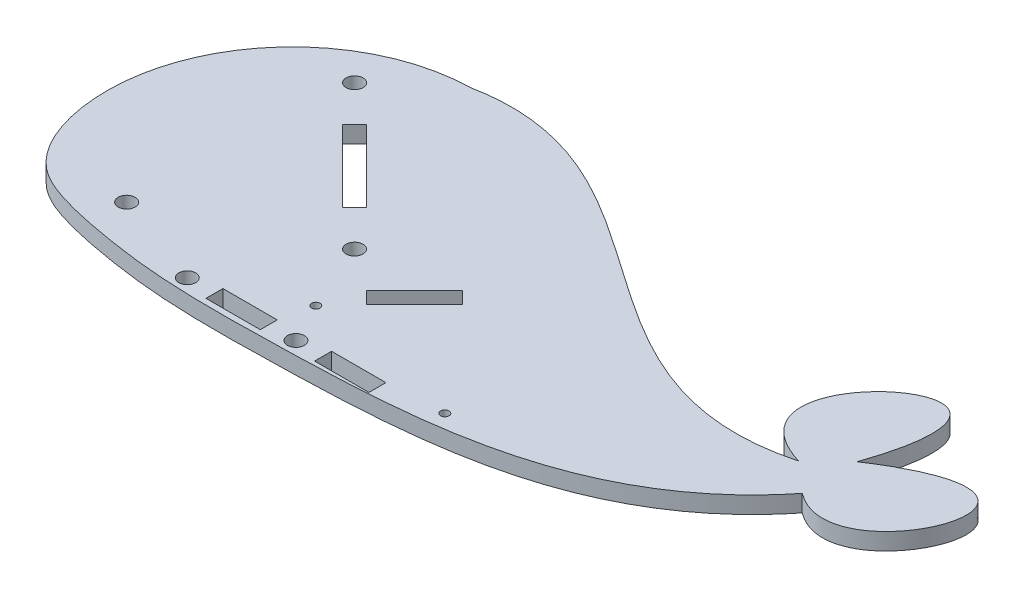
ISO-10303-21;
HEADER;
FILE_DESCRIPTION(('STEP AP214'),'2;1');
FILE_NAME('part.step','',(''),(''),'','','');
FILE_SCHEMA(('AUTOMOTIVE_DESIGN { 1 0 10303 214 1 1 1 1 }'));
ENDSEC;
DATA;
#1=APPLICATION_CONTEXT('core data for automotive mechanical design processes');
#2=APPLICATION_PROTOCOL_DEFINITION('international standard','automotive_design',2000,#1);
#3=PRODUCT_CONTEXT('',#1,'mechanical');
#4=PRODUCT('Part','Part','',(#3));
#5=PRODUCT_RELATED_PRODUCT_CATEGORY('part','',(#4));
#6=PRODUCT_DEFINITION_FORMATION('','',#4);
#7=PRODUCT_DEFINITION_CONTEXT('part definition',#1,'design');
#8=PRODUCT_DEFINITION('design','',#6,#7);
#9=PRODUCT_DEFINITION_SHAPE('','',#8);
#10=(LENGTH_UNIT() NAMED_UNIT(*) SI_UNIT(.MILLI.,.METRE.));
#11=(NAMED_UNIT(*) PLANE_ANGLE_UNIT() SI_UNIT($,.RADIAN.));
#12=(NAMED_UNIT(*) SI_UNIT($,.STERADIAN.) SOLID_ANGLE_UNIT());
#13=UNCERTAINTY_MEASURE_WITH_UNIT(LENGTH_MEASURE(1.E-05),#10,'distance_accuracy_value','');
#14=(GEOMETRIC_REPRESENTATION_CONTEXT(3) GLOBAL_UNCERTAINTY_ASSIGNED_CONTEXT((#13)) GLOBAL_UNIT_ASSIGNED_CONTEXT((#10,
#11,#12)) REPRESENTATION_CONTEXT('',''));
#15=CARTESIAN_POINT('',(0.,0.,0.));
#16=DIRECTION('',(0.,0.,1.));
#17=DIRECTION('',(1.,0.,0.));
#18=AXIS2_PLACEMENT_3D('',#15,#16,#17);
#19=CARTESIAN_POINT('',(78.1133713713061,3.175,-49.183057679841));
#20=DIRECTION('',(0.,1.,0.));
#21=DIRECTION('',(0.,0.,1.));
#22=AXIS2_PLACEMENT_3D('',#19,#20,#21);
#23=PLANE('',#22);
#24=CARTESIAN_POINT('',(58.0515880305925,3.175,-7.94090159907494));
#25=DIRECTION('',(0.,1.,0.));
#26=DIRECTION('',(0.,0.,1.));
#27=AXIS2_PLACEMENT_3D('',#24,#25,#26);
#28=CIRCLE('',#27,1.5875);
#29=CARTESIAN_POINT('',(58.0515880305925,3.175,-6.35340159907494));
#30=VERTEX_POINT('',#29);
#31=EDGE_CURVE('E203',#30,#30,#28,.T.);
#32=ORIENTED_EDGE('',*,*,#31,.F.);
#33=EDGE_LOOP('',(#32));
#34=FACE_BOUND('',#33,.T.);
#35=CARTESIAN_POINT('',(37.7315880305925,3.175,-7.94090159907494));
#36=DIRECTION('',(0.,1.,0.));
#37=DIRECTION('',(0.,0.,1.));
#38=AXIS2_PLACEMENT_3D('',#35,#36,#37);
#39=CIRCLE('',#38,1.5875);
#40=CARTESIAN_POINT('',(37.7315880305925,3.175,-6.35340159907494));
#41=VERTEX_POINT('',#40);
#42=EDGE_CURVE('E237',#41,#41,#39,.T.);
#43=ORIENTED_EDGE('',*,*,#42,.F.);
#44=EDGE_LOOP('',(#43));
#45=FACE_BOUND('',#44,.T.);
#46=CARTESIAN_POINT('',(48.7349934945603,3.175,-28.2262537655451));
#47=DIRECTION('',(0.,1.,0.));
#48=DIRECTION('',(0.,0.,1.));
#49=AXIS2_PLACEMENT_3D('',#46,#47,#48);
#50=CIRCLE('',#49,1.5875);
#51=CARTESIAN_POINT('',(48.7349934945603,3.175,-26.6387537655451));
#52=VERTEX_POINT('',#51);
#53=EDGE_CURVE('E256',#52,#52,#50,.T.);
#54=ORIENTED_EDGE('',*,*,#53,.F.);
#55=EDGE_LOOP('',(#54));
#56=FACE_BOUND('',#55,.T.);
#57=DIRECTION('',(0.707106781186554,0.,-0.707106781186541));
#58=VECTOR('',#57,1.);
#59=CARTESIAN_POINT('',(58.837781630763,3.175,-20.3685296596096));
#60=LINE('',#59,#58);
#61=CARTESIAN_POINT('',(58.837781630763,3.175,-20.3685296596096));
#62=VERTEX_POINT('',#61);
#63=CARTESIAN_POINT('',(67.8180377518322,3.175,-29.3487857806786));
#64=VERTEX_POINT('',#63);
#65=EDGE_CURVE('E270',#62,#64,#60,.T.);
#66=ORIENTED_EDGE('',*,*,#65,.F.);
#67=DIRECTION('',(0.707106781186541,0.,0.707106781186554));
#68=VECTOR('',#67,1.);
#69=CARTESIAN_POINT('',(56.5927176004957,3.175,-22.6135936898769));
#70=LINE('',#69,#68);
#71=CARTESIAN_POINT('',(56.5927176004957,3.175,-22.6135936898769));
#72=VERTEX_POINT('',#71);
#73=EDGE_CURVE('E268',#72,#62,#70,.T.);
#74=ORIENTED_EDGE('',*,*,#73,.F.);
#75=DIRECTION('',(-0.707106781186554,0.,0.707106781186542));
#76=VECTOR('',#75,1.);
#77=CARTESIAN_POINT('',(65.5729737215649,3.175,-31.5938498109459));
#78=LINE('',#77,#76);
#79=CARTESIAN_POINT('',(65.5729737215649,3.175,-31.5938498109459));
#80=VERTEX_POINT('',#79);
#81=EDGE_CURVE('E276',#80,#72,#78,.T.);
#82=ORIENTED_EDGE('',*,*,#81,.F.);
#83=DIRECTION('',(-0.70710678118654,0.,-0.707106781186555));
#84=VECTOR('',#83,1.);
#85=CARTESIAN_POINT('',(67.8180377518322,3.175,-29.3487857806786));
#86=LINE('',#85,#84);
#87=EDGE_CURVE('E273',#64,#80,#86,.T.);
#88=ORIENTED_EDGE('',*,*,#87,.F.);
#89=EDGE_LOOP('',(#66,#74,#82,#88));
#90=FACE_BOUND('',#89,.T.);
#91=DIRECTION('',(0.707106781186541,0.,0.707106781186554));
#92=VECTOR('',#91,1.);
#93=CARTESIAN_POINT('',(27.4068852070212,3.175,-47.3092980228173));
#94=LINE('',#93,#92);
#95=CARTESIAN_POINT('',(27.4068852070212,3.175,-47.3092980228173));
#96=VERTEX_POINT('',#95);
#97=CARTESIAN_POINT('',(40.8772693886248,3.175,-33.8389138412134));
#98=VERTEX_POINT('',#97);
#99=EDGE_CURVE('E301',#96,#98,#94,.T.);
#100=ORIENTED_EDGE('',*,*,#99,.F.);
#101=DIRECTION('',(-0.707106781186553,0.,0.707106781186542));
#102=VECTOR('',#101,1.);
#103=CARTESIAN_POINT('',(29.6519492372885,3.175,-49.5543620530846));
#104=LINE('',#103,#102);
#105=CARTESIAN_POINT('',(29.6519492372885,3.175,-49.5543620530846));
#106=VERTEX_POINT('',#105);
#107=EDGE_CURVE('E299',#106,#96,#104,.T.);
#108=ORIENTED_EDGE('',*,*,#107,.F.);
#109=DIRECTION('',(-0.707106781186541,0.,-0.707106781186554));
#110=VECTOR('',#109,1.);
#111=CARTESIAN_POINT('',(43.1223334188921,3.175,-36.0839778714807));
#112=LINE('',#111,#110);
#113=CARTESIAN_POINT('',(43.1223334188921,3.175,-36.0839778714807));
#114=VERTEX_POINT('',#113);
#115=EDGE_CURVE('E307',#114,#106,#112,.T.);
#116=ORIENTED_EDGE('',*,*,#115,.F.);
#117=DIRECTION('',(0.707106781186554,0.,-0.707106781186541));
#118=VECTOR('',#117,1.);
#119=CARTESIAN_POINT('',(40.8772693886248,3.175,-33.8389138412134));
#120=LINE('',#119,#118);
#121=EDGE_CURVE('E304',#98,#114,#120,.T.);
#122=ORIENTED_EDGE('',*,*,#121,.F.);
#123=EDGE_LOOP('',(#100,#108,#116,#122));
#124=FACE_BOUND('',#123,.T.);
#125=CARTESIAN_POINT('',(83.7807636130563,3.175,-10.0573233486938));
#126=DIRECTION('',(0.,1.,0.));
#127=DIRECTION('',(0.,0.,1.));
#128=AXIS2_PLACEMENT_3D('',#125,#126,#127);
#129=CIRCLE('',#128,0.793749999999987);
#130=CARTESIAN_POINT('',(83.7807636130563,3.175,-9.26357334869379));
#131=VERTEX_POINT('',#130);
#132=EDGE_CURVE('E330',#131,#131,#129,.T.);
#133=ORIENTED_EDGE('',*,*,#132,.F.);
#134=EDGE_LOOP('',(#133));
#135=FACE_BOUND('',#134,.T.);
#136=CARTESIAN_POINT('',(124.568961320486,3.175,-35.4189946031751));
#137=CARTESIAN_POINT('',(87.4425976087899,3.175,-25.5098867863513));
#138=CARTESIAN_POINT('',(68.1710690472409,3.175,-72.0943253475933));
#139=CARTESIAN_POINT('',(33.4970096818708,3.175,-65.2328304337192));
#140=B_SPLINE_CURVE_WITH_KNOTS('',3,(#136,#137,#138,#139),.UNSPECIFIED.,.F.,.F.,(4,4),(0.,1.),.UNSPECIFIED.);
#141=CARTESIAN_POINT('',(124.568961320486,3.175,-35.4189946031751));
#142=VERTEX_POINT('',#141);
#143=CARTESIAN_POINT('',(33.4970096818708,3.175,-65.2328304337192));
#144=VERTEX_POINT('',#143);
#145=EDGE_CURVE('E341',#142,#144,#140,.T.);
#146=ORIENTED_EDGE('',*,*,#145,.T.);
#147=CARTESIAN_POINT('',(33.4970096818708,3.175,-65.2328304337192));
#148=CARTESIAN_POINT('',(13.8358474751865,3.175,-64.7768302719291));
#149=CARTESIAN_POINT('',(-6.40976462592508,3.175,-41.7342933800762));
#150=CARTESIAN_POINT('',(3.62254537619549,3.175,-12.8065916478543));
#151=CARTESIAN_POINT('',(14.4019328924619,3.175,-8.75118532316161));
#152=CARTESIAN_POINT('',(21.8662695044655,3.175,-7.20890087227699));
#153=CARTESIAN_POINT('',(35.9768315791184,3.175,-4.99950791272443));
#154=CARTESIAN_POINT('',(73.9872009780918,3.175,-5.53660360771518));
#155=CARTESIAN_POINT('',(111.714388312721,3.175,-7.44742186682414));
#156=CARTESIAN_POINT('',(130.159055538713,3.175,-30.5276621622265));
#157=B_SPLINE_CURVE_WITH_KNOTS('',3,(#147,#148,#149,#150,#151,#152,#153,#154,#155,#156),
.UNSPECIFIED.,.F.,.F.,(4,1,1,1,1,1,1,4),(0.,0.267337016083873,0.357505563411061,
0.391567422740846,0.432956685234274,0.471433917471498,0.602900812961477,1.),.UNSPECIFIED.);
#158=CARTESIAN_POINT('',(130.159055538713,3.175,-30.5276621622265));
#159=VERTEX_POINT('',#158);
#160=EDGE_CURVE('E347',#144,#159,#157,.T.);
#161=ORIENTED_EDGE('',*,*,#160,.T.);
#162=CARTESIAN_POINT('',(130.159055538713,3.175,-30.5276621622265));
#163=CARTESIAN_POINT('',(146.21563141427,3.175,-18.4305012953225));
#164=CARTESIAN_POINT('',(163.066903523027,3.175,-62.4860216713314));
#165=CARTESIAN_POINT('',(130.159055538713,3.175,-40.776168228976));
#166=B_SPLINE_CURVE_WITH_KNOTS('',3,(#162,#163,#164,#165),.UNSPECIFIED.,.F.,.F.,(4,4),(0.,1.),.UNSPECIFIED.);
#167=CARTESIAN_POINT('',(130.159055538713,3.175,-40.776168228976));
#168=VERTEX_POINT('',#167);
#169=EDGE_CURVE('E356',#159,#168,#166,.T.);
#170=ORIENTED_EDGE('',*,*,#169,.T.);
#171=CARTESIAN_POINT('',(130.159055538713,3.175,-40.776168228976));
#172=CARTESIAN_POINT('',(143.399689124556,3.175,-78.8878765073391));
#173=CARTESIAN_POINT('',(97.9717618125883,3.175,-43.7536173733712));
#174=CARTESIAN_POINT('',(124.568961320486,3.175,-35.4189946031751));
#175=B_SPLINE_CURVE_WITH_KNOTS('',3,(#171,#172,#173,#174),.UNSPECIFIED.,.F.,.F.,(4,4),(0.,1.),.UNSPECIFIED.);
#176=EDGE_CURVE('E378',#168,#142,#175,.T.);
#177=ORIENTED_EDGE('',*,*,#176,.T.);
#178=EDGE_LOOP('',(#146,#161,#170,#177));
#179=FACE_BOUND('',#178,.T.);
#180=CARTESIAN_POINT('',(54.2707729620133,3.175,-15.4375271611116));
#181=DIRECTION('',(0.,1.,0.));
#182=DIRECTION('',(0.,0.,1.));
#183=AXIS2_PLACEMENT_3D('',#180,#181,#182);
#184=CIRCLE('',#183,0.793749999999999);
#185=CARTESIAN_POINT('',(54.2707729620133,3.175,-14.6437771611116));
#186=VERTEX_POINT('',#185);
#187=EDGE_CURVE('E336',#186,#186,#184,.T.);
#188=ORIENTED_EDGE('',*,*,#187,.F.);
#189=EDGE_LOOP('',(#188));
#190=FACE_BOUND('',#189,.T.);
#191=CARTESIAN_POINT('',(21.794225131353,3.175,-55.1670221287529));
#192=DIRECTION('',(0.,1.,0.));
#193=DIRECTION('',(0.,0.,1.));
#194=AXIS2_PLACEMENT_3D('',#191,#192,#193);
#195=CIRCLE('',#194,1.5875);
#196=CARTESIAN_POINT('',(21.794225131353,3.175,-53.5795221287529));
#197=VERTEX_POINT('',#196);
#198=EDGE_CURVE('E262',#197,#197,#195,.T.);
#199=ORIENTED_EDGE('',*,*,#198,.F.);
#200=EDGE_LOOP('',(#199));
#201=FACE_BOUND('',#200,.T.);
#202=CARTESIAN_POINT('',(19.8209748998434,3.175,-14.5195015990749));
#203=DIRECTION('',(0.,1.,0.));
#204=DIRECTION('',(0.,0.,1.));
#205=AXIS2_PLACEMENT_3D('',#202,#203,#204);
#206=CIRCLE('',#205,1.5875);
#207=CARTESIAN_POINT('',(19.8209748998434,3.175,-12.9320015990749));
#208=VERTEX_POINT('',#207);
#209=EDGE_CURVE('E250',#208,#208,#206,.T.);
#210=ORIENTED_EDGE('',*,*,#209,.F.);
#211=EDGE_LOOP('',(#210));
#212=FACE_BOUND('',#211,.T.);
#213=DIRECTION('',(1.,0.,0.));
#214=VECTOR('',#213,1.);
#215=CARTESIAN_POINT('',(0.,3.175,-9.52840159907494));
#216=LINE('',#215,#214);
#217=CARTESIAN_POINT('',(42.8115880305925,3.175,-9.52840159907494));
#218=VERTEX_POINT('',#217);
#219=CARTESIAN_POINT('',(52.9715880305925,3.175,-9.52840159907494));
#220=VERTEX_POINT('',#219);
#221=EDGE_CURVE('E227',#218,#220,#216,.T.);
#222=ORIENTED_EDGE('',*,*,#221,.T.);
#223=DIRECTION('',(0.,0.,1.));
#224=VECTOR('',#223,1.);
#225=CARTESIAN_POINT('',(52.9715880305925,3.175,0.));
#226=LINE('',#225,#224);
#227=CARTESIAN_POINT('',(52.9715880305925,3.175,-6.35340159907494));
#228=VERTEX_POINT('',#227);
#229=EDGE_CURVE('E210',#220,#228,#226,.T.);
#230=ORIENTED_EDGE('',*,*,#229,.T.);
#231=DIRECTION('',(1.,0.,0.));
#232=VECTOR('',#231,1.);
#233=CARTESIAN_POINT('',(0.,3.175,-6.35340159907493));
#234=LINE('',#233,#232);
#235=CARTESIAN_POINT('',(42.8115880305925,3.175,-6.35340159907494));
#236=VERTEX_POINT('',#235);
#237=EDGE_CURVE('E216',#236,#228,#234,.T.);
#238=ORIENTED_EDGE('',*,*,#237,.F.);
#239=DIRECTION('',(0.,0.,1.));
#240=VECTOR('',#239,1.);
#241=CARTESIAN_POINT('',(42.8115880305925,3.175,0.));
#242=LINE('',#241,#240);
#243=EDGE_CURVE('E230',#218,#236,#242,.T.);
#244=ORIENTED_EDGE('',*,*,#243,.F.);
#245=EDGE_LOOP('',(#222,#230,#238,#244));
#246=FACE_BOUND('',#245,.T.);
#247=DIRECTION('',(1.,0.,0.));
#248=VECTOR('',#247,1.);
#249=CARTESIAN_POINT('',(0.,3.175,-9.52840159907494));
#250=LINE('',#249,#248);
#251=CARTESIAN_POINT('',(63.1315880305925,3.175,-9.52840159907494));
#252=VERTEX_POINT('',#251);
#253=CARTESIAN_POINT('',(73.2915880305925,3.175,-9.52840159907494));
#254=VERTEX_POINT('',#253);
#255=EDGE_CURVE('E197',#252,#254,#250,.T.);
#256=ORIENTED_EDGE('',*,*,#255,.T.);
#257=DIRECTION('',(0.,0.,1.));
#258=VECTOR('',#257,1.);
#259=CARTESIAN_POINT('',(73.2915880305925,3.175,0.));
#260=LINE('',#259,#258);
#261=CARTESIAN_POINT('',(73.2915880305925,3.175,-6.35340159907494));
#262=VERTEX_POINT('',#261);
#263=EDGE_CURVE('E49',#254,#262,#260,.T.);
#264=ORIENTED_EDGE('',*,*,#263,.T.);
#265=DIRECTION('',(1.,0.,0.));
#266=VECTOR('',#265,1.);
#267=CARTESIAN_POINT('',(0.,3.175,-6.35340159907493));
#268=LINE('',#267,#266);
#269=CARTESIAN_POINT('',(63.1315880305925,3.175,-6.35340159907494));
#270=VERTEX_POINT('',#269);
#271=EDGE_CURVE('E188',#270,#262,#268,.T.);
#272=ORIENTED_EDGE('',*,*,#271,.F.);
#273=DIRECTION('',(0.,0.,1.));
#274=VECTOR('',#273,1.);
#275=CARTESIAN_POINT('',(63.1315880305925,3.175,0.));
#276=LINE('',#275,#274);
#277=EDGE_CURVE('E191',#252,#270,#276,.T.);
#278=ORIENTED_EDGE('',*,*,#277,.F.);
#279=EDGE_LOOP('',(#256,#264,#272,#278));
#280=FACE_BOUND('',#279,.T.);
#281=ADVANCED_FACE('F33',(#34,#45,#56,#90,#124,#135,#179,#190,#201,#212,#246,#280),#23,.T.);
#282=CARTESIAN_POINT('',(78.1133713713061,0.,-49.183057679841));
#283=DIRECTION('',(0.,1.,0.));
#284=DIRECTION('',(0.,0.,1.));
#285=AXIS2_PLACEMENT_3D('',#282,#283,#284);
#286=PLANE('',#285);
#287=DIRECTION('',(0.,0.,1.));
#288=VECTOR('',#287,1.);
#289=CARTESIAN_POINT('',(52.9715880305925,0.,0.));
#290=LINE('',#289,#288);
#291=CARTESIAN_POINT('',(52.9715880305925,0.,-9.52840159907494));
#292=VERTEX_POINT('',#291);
#293=CARTESIAN_POINT('',(52.9715880305925,0.,-6.35340159907494));
#294=VERTEX_POINT('',#293);
#295=EDGE_CURVE('E213',#292,#294,#290,.T.);
#296=ORIENTED_EDGE('',*,*,#295,.F.);
#297=DIRECTION('',(1.,0.,0.));
#298=VECTOR('',#297,1.);
#299=CARTESIAN_POINT('',(0.,0.,-9.52840159907494));
#300=LINE('',#299,#298);
#301=CARTESIAN_POINT('',(42.8115880305925,0.,-9.52840159907494));
#302=VERTEX_POINT('',#301);
#303=EDGE_CURVE('E215',#302,#292,#300,.T.);
#304=ORIENTED_EDGE('',*,*,#303,.F.);
#305=DIRECTION('',(0.,0.,1.));
#306=VECTOR('',#305,1.);
#307=CARTESIAN_POINT('',(42.8115880305925,0.,0.));
#308=LINE('',#307,#306);
#309=CARTESIAN_POINT('',(42.8115880305925,0.,-6.35340159907494));
#310=VERTEX_POINT('',#309);
#311=EDGE_CURVE('E218',#302,#310,#308,.T.);
#312=ORIENTED_EDGE('',*,*,#311,.T.);
#313=DIRECTION('',(1.,0.,0.));
#314=VECTOR('',#313,1.);
#315=CARTESIAN_POINT('',(0.,0.,-6.35340159907493));
#316=LINE('',#315,#314);
#317=EDGE_CURVE('E221',#310,#294,#316,.T.);
#318=ORIENTED_EDGE('',*,*,#317,.T.);
#319=EDGE_LOOP('',(#296,#304,#312,#318));
#320=FACE_BOUND('',#319,.T.);
#321=CARTESIAN_POINT('',(37.7315880305925,0.,-7.94090159907494));
#322=DIRECTION('',(0.,1.,0.));
#323=DIRECTION('',(0.,0.,1.));
#324=AXIS2_PLACEMENT_3D('',#321,#322,#323);
#325=CIRCLE('',#324,1.5875);
#326=CARTESIAN_POINT('',(37.7315880305925,0.,-6.35340159907494));
#327=VERTEX_POINT('',#326);
#328=EDGE_CURVE('E244',#327,#327,#325,.T.);
#329=ORIENTED_EDGE('',*,*,#328,.T.);
#330=EDGE_LOOP('',(#329));
#331=FACE_BOUND('',#330,.T.);
#332=DIRECTION('',(-0.707106781186553,0.,0.707106781186542));
#333=VECTOR('',#332,1.);
#334=CARTESIAN_POINT('',(29.6519492372885,0.,-49.5543620530846));
#335=LINE('',#334,#333);
#336=CARTESIAN_POINT('',(29.6519492372885,0.,-49.5543620530846));
#337=VERTEX_POINT('',#336);
#338=CARTESIAN_POINT('',(27.4068852070212,0.,-47.3092980228173));
#339=VERTEX_POINT('',#338);
#340=EDGE_CURVE('E298',#337,#339,#335,.T.);
#341=ORIENTED_EDGE('',*,*,#340,.T.);
#342=DIRECTION('',(0.707106781186541,0.,0.707106781186554));
#343=VECTOR('',#342,1.);
#344=CARTESIAN_POINT('',(27.4068852070212,0.,-47.3092980228173));
#345=LINE('',#344,#343);
#346=CARTESIAN_POINT('',(40.8772693886248,0.,-33.8389138412134));
#347=VERTEX_POINT('',#346);
#348=EDGE_CURVE('E312',#339,#347,#345,.T.);
#349=ORIENTED_EDGE('',*,*,#348,.T.);
#350=DIRECTION('',(0.707106781186554,0.,-0.707106781186541));
#351=VECTOR('',#350,1.);
#352=CARTESIAN_POINT('',(40.8772693886248,0.,-33.8389138412134));
#353=LINE('',#352,#351);
#354=CARTESIAN_POINT('',(43.1223334188921,0.,-36.0839778714807));
#355=VERTEX_POINT('',#354);
#356=EDGE_CURVE('E315',#347,#355,#353,.T.);
#357=ORIENTED_EDGE('',*,*,#356,.T.);
#358=DIRECTION('',(-0.707106781186541,0.,-0.707106781186554));
#359=VECTOR('',#358,1.);
#360=CARTESIAN_POINT('',(43.1223334188921,0.,-36.0839778714807));
#361=LINE('',#360,#359);
#362=EDGE_CURVE('E302',#355,#337,#361,.T.);
#363=ORIENTED_EDGE('',*,*,#362,.T.);
#364=EDGE_LOOP('',(#341,#349,#357,#363));
#365=FACE_BOUND('',#364,.T.);
#366=CARTESIAN_POINT('',(124.568961320486,0.,-35.4189946031751));
#367=CARTESIAN_POINT('',(87.4425976087899,0.,-25.5098867863513));
#368=CARTESIAN_POINT('',(68.1710690472409,0.,-72.0943253475933));
#369=CARTESIAN_POINT('',(33.4970096818708,0.,-65.2328304337192));
#370=B_SPLINE_CURVE_WITH_KNOTS('',3,(#366,#367,#368,#369),.UNSPECIFIED.,.F.,.F.,(4,4),(0.,1.),.UNSPECIFIED.);
#371=CARTESIAN_POINT('',(124.568961320486,0.,-35.4189946031751));
#372=VERTEX_POINT('',#371);
#373=CARTESIAN_POINT('',(33.4970096818708,0.,-65.2328304337192));
#374=VERTEX_POINT('',#373);
#375=EDGE_CURVE('E339',#372,#374,#370,.T.);
#376=ORIENTED_EDGE('',*,*,#375,.F.);
#377=CARTESIAN_POINT('',(130.159055538713,0.,-40.776168228976));
#378=CARTESIAN_POINT('',(143.399689124556,0.,-78.8878765073391));
#379=CARTESIAN_POINT('',(97.9717618125883,0.,-43.7536173733712));
#380=CARTESIAN_POINT('',(124.568961320486,0.,-35.4189946031751));
#381=B_SPLINE_CURVE_WITH_KNOTS('',3,(#377,#378,#379,#380),.UNSPECIFIED.,.F.,.F.,(4,4),(0.,1.),.UNSPECIFIED.);
#382=CARTESIAN_POINT('',(130.159055538713,0.,-40.776168228976));
#383=VERTEX_POINT('',#382);
#384=EDGE_CURVE('E348',#383,#372,#381,.T.);
#385=ORIENTED_EDGE('',*,*,#384,.F.);
#386=CARTESIAN_POINT('',(130.159055538713,0.,-30.5276621622265));
#387=CARTESIAN_POINT('',(146.21563141427,0.,-18.4305012953225));
#388=CARTESIAN_POINT('',(163.066903523027,0.,-62.4860216713314));
#389=CARTESIAN_POINT('',(130.159055538713,0.,-40.776168228976));
#390=B_SPLINE_CURVE_WITH_KNOTS('',3,(#386,#387,#388,#389),.UNSPECIFIED.,.F.,.F.,(4,4),(0.,1.),.UNSPECIFIED.);
#391=CARTESIAN_POINT('',(130.159055538713,0.,-30.5276621622265));
#392=VERTEX_POINT('',#391);
#393=EDGE_CURVE('E398',#392,#383,#390,.T.);
#394=ORIENTED_EDGE('',*,*,#393,.F.);
#395=CARTESIAN_POINT('',(33.4970096818708,0.,-65.2328304337192));
#396=CARTESIAN_POINT('',(13.8358474751865,0.,-64.7768302719291));
#397=CARTESIAN_POINT('',(-6.40976462592508,0.,-41.7342933800762));
#398=CARTESIAN_POINT('',(3.62254537619549,0.,-12.8065916478543));
#399=CARTESIAN_POINT('',(14.4019328924619,0.,-8.75118532316161));
#400=CARTESIAN_POINT('',(21.8662695044655,0.,-7.20890087227699));
#401=CARTESIAN_POINT('',(35.9768315791184,0.,-4.99950791272443));
#402=CARTESIAN_POINT('',(73.9872009780918,0.,-5.53660360771518));
#403=CARTESIAN_POINT('',(111.714388312721,0.,-7.44742186682414));
#404=CARTESIAN_POINT('',(130.159055538713,0.,-30.5276621622265));
#405=B_SPLINE_CURVE_WITH_KNOTS('',3,(#395,#396,#397,#398,#399,#400,#401,#402,#403,#404),
.UNSPECIFIED.,.F.,.F.,(4,1,1,1,1,1,1,4),(0.,0.267337016083873,0.357505563411061,
0.391567422740846,0.432956685234274,0.471433917471498,0.602900812961477,1.),.UNSPECIFIED.);
#406=EDGE_CURVE('E391',#374,#392,#405,.T.);
#407=ORIENTED_EDGE('',*,*,#406,.F.);
#408=EDGE_LOOP('',(#376,#385,#394,#407));
#409=FACE_BOUND('',#408,.T.);
#410=CARTESIAN_POINT('',(54.2707729620133,0.,-15.4375271611116));
#411=DIRECTION('',(0.,1.,0.));
#412=DIRECTION('',(0.,0.,1.));
#413=AXIS2_PLACEMENT_3D('',#410,#411,#412);
#414=CIRCLE('',#413,0.793749999999999);
#415=CARTESIAN_POINT('',(54.2707729620133,0.,-14.6437771611116));
#416=VERTEX_POINT('',#415);
#417=EDGE_CURVE('E333',#416,#416,#414,.T.);
#418=ORIENTED_EDGE('',*,*,#417,.T.);
#419=EDGE_LOOP('',(#418));
#420=FACE_BOUND('',#419,.T.);
#421=CARTESIAN_POINT('',(83.7807636130563,0.,-10.0573233486938));
#422=DIRECTION('',(0.,1.,0.));
#423=DIRECTION('',(0.,0.,1.));
#424=AXIS2_PLACEMENT_3D('',#421,#422,#423);
#425=CIRCLE('',#424,0.793749999999987);
#426=CARTESIAN_POINT('',(83.7807636130563,0.,-9.26357334869379));
#427=VERTEX_POINT('',#426);
#428=EDGE_CURVE('E329',#427,#427,#425,.T.);
#429=ORIENTED_EDGE('',*,*,#428,.T.);
#430=EDGE_LOOP('',(#429));
#431=FACE_BOUND('',#430,.T.);
#432=DIRECTION('',(0.707106781186541,0.,0.707106781186554));
#433=VECTOR('',#432,1.);
#434=CARTESIAN_POINT('',(56.5927176004957,0.,-22.6135936898769));
#435=LINE('',#434,#433);
#436=CARTESIAN_POINT('',(56.5927176004957,0.,-22.6135936898769));
#437=VERTEX_POINT('',#436);
#438=CARTESIAN_POINT('',(58.837781630763,0.,-20.3685296596096));
#439=VERTEX_POINT('',#438);
#440=EDGE_CURVE('E265',#437,#439,#435,.T.);
#441=ORIENTED_EDGE('',*,*,#440,.T.);
#442=DIRECTION('',(0.707106781186554,0.,-0.707106781186541));
#443=VECTOR('',#442,1.);
#444=CARTESIAN_POINT('',(58.837781630763,0.,-20.3685296596096));
#445=LINE('',#444,#443);
#446=CARTESIAN_POINT('',(67.8180377518322,0.,-29.3487857806786));
#447=VERTEX_POINT('',#446);
#448=EDGE_CURVE('E281',#439,#447,#445,.T.);
#449=ORIENTED_EDGE('',*,*,#448,.T.);
#450=DIRECTION('',(-0.70710678118654,0.,-0.707106781186555));
#451=VECTOR('',#450,1.);
#452=CARTESIAN_POINT('',(67.8180377518322,0.,-29.3487857806786));
#453=LINE('',#452,#451);
#454=CARTESIAN_POINT('',(65.5729737215649,0.,-31.5938498109459));
#455=VERTEX_POINT('',#454);
#456=EDGE_CURVE('E284',#447,#455,#453,.T.);
#457=ORIENTED_EDGE('',*,*,#456,.T.);
#458=DIRECTION('',(-0.707106781186554,0.,0.707106781186542));
#459=VECTOR('',#458,1.);
#460=CARTESIAN_POINT('',(65.5729737215649,0.,-31.5938498109459));
#461=LINE('',#460,#459);
#462=EDGE_CURVE('E271',#455,#437,#461,.T.);
#463=ORIENTED_EDGE('',*,*,#462,.T.);
#464=EDGE_LOOP('',(#441,#449,#457,#463));
#465=FACE_BOUND('',#464,.T.);
#466=CARTESIAN_POINT('',(21.794225131353,0.,-55.1670221287529));
#467=DIRECTION('',(0.,1.,0.));
#468=DIRECTION('',(0.,0.,1.));
#469=AXIS2_PLACEMENT_3D('',#466,#467,#468);
#470=CIRCLE('',#469,1.5875);
#471=CARTESIAN_POINT('',(21.794225131353,0.,-53.5795221287529));
#472=VERTEX_POINT('',#471);
#473=EDGE_CURVE('E259',#472,#472,#470,.T.);
#474=ORIENTED_EDGE('',*,*,#473,.T.);
#475=EDGE_LOOP('',(#474));
#476=FACE_BOUND('',#475,.T.);
#477=CARTESIAN_POINT('',(48.7349934945603,0.,-28.2262537655451));
#478=DIRECTION('',(0.,1.,0.));
#479=DIRECTION('',(0.,0.,1.));
#480=AXIS2_PLACEMENT_3D('',#477,#478,#479);
#481=CIRCLE('',#480,1.5875);
#482=CARTESIAN_POINT('',(48.7349934945603,0.,-26.6387537655451));
#483=VERTEX_POINT('',#482);
#484=EDGE_CURVE('E253',#483,#483,#481,.T.);
#485=ORIENTED_EDGE('',*,*,#484,.T.);
#486=EDGE_LOOP('',(#485));
#487=FACE_BOUND('',#486,.T.);
#488=CARTESIAN_POINT('',(19.8209748998434,0.,-14.5195015990749));
#489=DIRECTION('',(0.,1.,0.));
#490=DIRECTION('',(0.,0.,1.));
#491=AXIS2_PLACEMENT_3D('',#488,#489,#490);
#492=CIRCLE('',#491,1.5875);
#493=CARTESIAN_POINT('',(19.8209748998434,0.,-12.9320015990749));
#494=VERTEX_POINT('',#493);
#495=EDGE_CURVE('E247',#494,#494,#492,.T.);
#496=ORIENTED_EDGE('',*,*,#495,.T.);
#497=EDGE_LOOP('',(#496));
#498=FACE_BOUND('',#497,.T.);
#499=CARTESIAN_POINT('',(58.0515880305925,0.,-7.94090159907494));
#500=DIRECTION('',(0.,1.,0.));
#501=DIRECTION('',(0.,0.,1.));
#502=AXIS2_PLACEMENT_3D('',#499,#500,#501);
#503=CIRCLE('',#502,1.5875);
#504=CARTESIAN_POINT('',(58.0515880305925,0.,-6.35340159907494));
#505=VERTEX_POINT('',#504);
#506=EDGE_CURVE('E207',#505,#505,#503,.T.);
#507=ORIENTED_EDGE('',*,*,#506,.T.);
#508=EDGE_LOOP('',(#507));
#509=FACE_BOUND('',#508,.T.);
#510=DIRECTION('',(0.,0.,1.));
#511=VECTOR('',#510,1.);
#512=CARTESIAN_POINT('',(73.2915880305925,0.,0.));
#513=LINE('',#512,#511);
#514=CARTESIAN_POINT('',(73.2915880305925,0.,-9.52840159907494));
#515=VERTEX_POINT('',#514);
#516=CARTESIAN_POINT('',(73.2915880305925,0.,-6.35340159907494));
#517=VERTEX_POINT('',#516);
#518=EDGE_CURVE('E179',#515,#517,#513,.T.);
#519=ORIENTED_EDGE('',*,*,#518,.F.);
#520=DIRECTION('',(1.,0.,0.));
#521=VECTOR('',#520,1.);
#522=CARTESIAN_POINT('',(0.,0.,-9.52840159907494));
#523=LINE('',#522,#521);
#524=CARTESIAN_POINT('',(63.1315880305925,0.,-9.52840159907494));
#525=VERTEX_POINT('',#524);
#526=EDGE_CURVE('E171',#525,#515,#523,.T.);
#527=ORIENTED_EDGE('',*,*,#526,.F.);
#528=DIRECTION('',(0.,0.,1.));
#529=VECTOR('',#528,1.);
#530=CARTESIAN_POINT('',(63.1315880305925,0.,0.));
#531=LINE('',#530,#529);
#532=CARTESIAN_POINT('',(63.1315880305925,0.,-6.35340159907494));
#533=VERTEX_POINT('',#532);
#534=EDGE_CURVE('E57',#525,#533,#531,.T.);
#535=ORIENTED_EDGE('',*,*,#534,.T.);
#536=DIRECTION('',(1.,0.,0.));
#537=VECTOR('',#536,1.);
#538=CARTESIAN_POINT('',(0.,0.,-6.35340159907493));
#539=LINE('',#538,#537);
#540=EDGE_CURVE('E183',#533,#517,#539,.T.);
#541=ORIENTED_EDGE('',*,*,#540,.T.);
#542=EDGE_LOOP('',(#519,#527,#535,#541));
#543=FACE_BOUND('',#542,.T.);
#544=ADVANCED_FACE('F186',(#320,#331,#365,#409,#420,#431,#465,#476,#487,#498,#509,#543),#286,.F.);
#545=DIRECTION('',(0.,-1.,0.));
#546=VECTOR('',#545,1.);
#547=SURFACE_OF_LINEAR_EXTRUSION('',#140,#546);
#548=ORIENTED_EDGE('',*,*,#375,.T.);
#549=DIRECTION('',(0.,-1.,0.));
#550=VECTOR('',#549,1.);
#551=CARTESIAN_POINT('',(33.4970096818708,3.175,-65.2328304337192));
#552=LINE('',#551,#550);
#553=EDGE_CURVE('E11',#144,#374,#552,.T.);
#554=ORIENTED_EDGE('',*,*,#553,.F.);
#555=ORIENTED_EDGE('',*,*,#145,.F.);
#556=DIRECTION('',(0.,-1.,0.));
#557=VECTOR('',#556,1.);
#558=CARTESIAN_POINT('',(124.568961320486,3.175,-35.4189946031751));
#559=LINE('',#558,#557);
#560=EDGE_CURVE('E383',#142,#372,#559,.T.);
#561=ORIENTED_EDGE('',*,*,#560,.T.);
#562=EDGE_LOOP('',(#548,#554,#555,#561));
#563=FACE_BOUND('',#562,.T.);
#564=ADVANCED_FACE('F35',(#563),#547,.F.);
#565=DIRECTION('',(0.,-1.,0.));
#566=VECTOR('',#565,1.);
#567=SURFACE_OF_LINEAR_EXTRUSION('',#157,#566);
#568=ORIENTED_EDGE('',*,*,#406,.T.);
#569=DIRECTION('',(0.,-1.,0.));
#570=VECTOR('',#569,1.);
#571=CARTESIAN_POINT('',(130.159055538713,3.175,-30.5276621622265));
#572=LINE('',#571,#570);
#573=EDGE_CURVE('E42',#159,#392,#572,.T.);
#574=ORIENTED_EDGE('',*,*,#573,.F.);
#575=ORIENTED_EDGE('',*,*,#160,.F.);
#576=ORIENTED_EDGE('',*,*,#553,.T.);
#577=EDGE_LOOP('',(#568,#574,#575,#576));
#578=FACE_BOUND('',#577,.T.);
#579=ADVANCED_FACE('F364',(#578),#567,.F.);
#580=DIRECTION('',(0.,-1.,0.));
#581=VECTOR('',#580,1.);
#582=SURFACE_OF_LINEAR_EXTRUSION('',#166,#581);
#583=ORIENTED_EDGE('',*,*,#393,.T.);
#584=DIRECTION('',(0.,-1.,0.));
#585=VECTOR('',#584,1.);
#586=CARTESIAN_POINT('',(130.159055538713,3.175,-40.776168228976));
#587=LINE('',#586,#585);
#588=EDGE_CURVE('E416',#168,#383,#587,.T.);
#589=ORIENTED_EDGE('',*,*,#588,.F.);
#590=ORIENTED_EDGE('',*,*,#169,.F.);
#591=ORIENTED_EDGE('',*,*,#573,.T.);
#592=EDGE_LOOP('',(#583,#589,#590,#591));
#593=FACE_BOUND('',#592,.T.);
#594=ADVANCED_FACE('F367',(#593),#582,.F.);
#595=DIRECTION('',(0.,-1.,0.));
#596=VECTOR('',#595,1.);
#597=SURFACE_OF_LINEAR_EXTRUSION('',#175,#596);
#598=ORIENTED_EDGE('',*,*,#384,.T.);
#599=ORIENTED_EDGE('',*,*,#560,.F.);
#600=ORIENTED_EDGE('',*,*,#176,.F.);
#601=ORIENTED_EDGE('',*,*,#588,.T.);
#602=EDGE_LOOP('',(#598,#599,#600,#601));
#603=FACE_BOUND('',#602,.T.);
#604=ADVANCED_FACE('F371',(#603),#597,.F.);
#605=CARTESIAN_POINT('',(54.2707729620133,3.175,-15.4375271611116));
#606=DIRECTION('',(0.,-1.,0.));
#607=DIRECTION('',(0.,0.,-1.));
#608=AXIS2_PLACEMENT_3D('',#605,#606,#607);
#609=CYLINDRICAL_SURFACE('',#608,0.793749999999999);
#610=ORIENTED_EDGE('',*,*,#187,.T.);
#611=EDGE_LOOP('',(#610));
#612=FACE_BOUND('',#611,.T.);
#613=ORIENTED_EDGE('',*,*,#417,.F.);
#614=EDGE_LOOP('',(#613));
#615=FACE_BOUND('',#614,.T.);
#616=ADVANCED_FACE('F375',(#612,#615),#609,.F.);
#617=CARTESIAN_POINT('',(83.7807636130563,3.175,-10.0573233486938));
#618=DIRECTION('',(0.,-1.,0.));
#619=DIRECTION('',(0.,0.,-1.));
#620=AXIS2_PLACEMENT_3D('',#617,#618,#619);
#621=CYLINDRICAL_SURFACE('',#620,0.793749999999987);
#622=ORIENTED_EDGE('',*,*,#132,.T.);
#623=EDGE_LOOP('',(#622));
#624=FACE_BOUND('',#623,.T.);
#625=ORIENTED_EDGE('',*,*,#428,.F.);
#626=EDGE_LOOP('',(#625));
#627=FACE_BOUND('',#626,.T.);
#628=ADVANCED_FACE('F528',(#624,#627),#621,.F.);
#629=CARTESIAN_POINT('',(29.6519492372885,3.175,-49.5543620530846));
#630=DIRECTION('',(0.707106781186542,0.,0.707106781186553));
#631=DIRECTION('',(0.707106781186553,0.,-0.707106781186542));
#632=AXIS2_PLACEMENT_3D('',#629,#630,#631);
#633=PLANE('',#632);
#634=ORIENTED_EDGE('',*,*,#340,.F.);
#635=DIRECTION('',(0.,-1.,0.));
#636=VECTOR('',#635,1.);
#637=CARTESIAN_POINT('',(29.6519492372885,3.175,-49.5543620530846));
#638=LINE('',#637,#636);
#639=EDGE_CURVE('E309',#106,#337,#638,.T.);
#640=ORIENTED_EDGE('',*,*,#639,.F.);
#641=ORIENTED_EDGE('',*,*,#107,.T.);
#642=DIRECTION('',(0.,-1.,0.));
#643=VECTOR('',#642,1.);
#644=CARTESIAN_POINT('',(27.4068852070212,3.175,-47.3092980228173));
#645=LINE('',#644,#643);
#646=EDGE_CURVE('E326',#96,#339,#645,.T.);
#647=ORIENTED_EDGE('',*,*,#646,.T.);
#648=EDGE_LOOP('',(#634,#640,#641,#647));
#649=FACE_BOUND('',#648,.T.);
#650=ADVANCED_FACE('F524',(#649),#633,.T.);
#651=CARTESIAN_POINT('',(27.4068852070212,3.175,-47.3092980228173));
#652=DIRECTION('',(0.707106781186554,0.,-0.707106781186541));
#653=DIRECTION('',(-0.707106781186541,0.,-0.707106781186554));
#654=AXIS2_PLACEMENT_3D('',#651,#652,#653);
#655=PLANE('',#654);
#656=ORIENTED_EDGE('',*,*,#348,.F.);
#657=ORIENTED_EDGE('',*,*,#646,.F.);
#658=ORIENTED_EDGE('',*,*,#99,.T.);
#659=DIRECTION('',(0.,-1.,0.));
#660=VECTOR('',#659,1.);
#661=CARTESIAN_POINT('',(40.8772693886248,3.175,-33.8389138412134));
#662=LINE('',#661,#660);
#663=EDGE_CURVE('E324',#98,#347,#662,.T.);
#664=ORIENTED_EDGE('',*,*,#663,.T.);
#665=EDGE_LOOP('',(#656,#657,#658,#664));
#666=FACE_BOUND('',#665,.T.);
#667=ADVANCED_FACE('F520',(#666),#655,.T.);
#668=CARTESIAN_POINT('',(40.8772693886248,3.175,-33.8389138412134));
#669=DIRECTION('',(-0.707106781186541,0.,-0.707106781186554));
#670=DIRECTION('',(-0.707106781186554,0.,0.707106781186541));
#671=AXIS2_PLACEMENT_3D('',#668,#669,#670);
#672=PLANE('',#671);
#673=ORIENTED_EDGE('',*,*,#356,.F.);
#674=ORIENTED_EDGE('',*,*,#663,.F.);
#675=ORIENTED_EDGE('',*,*,#121,.T.);
#676=DIRECTION('',(0.,-1.,0.));
#677=VECTOR('',#676,1.);
#678=CARTESIAN_POINT('',(43.1223334188921,3.175,-36.0839778714807));
#679=LINE('',#678,#677);
#680=EDGE_CURVE('E322',#114,#355,#679,.T.);
#681=ORIENTED_EDGE('',*,*,#680,.T.);
#682=EDGE_LOOP('',(#673,#674,#675,#681));
#683=FACE_BOUND('',#682,.T.);
#684=ADVANCED_FACE('F516',(#683),#672,.T.);
#685=CARTESIAN_POINT('',(43.1223334188921,3.175,-36.0839778714807));
#686=DIRECTION('',(-0.707106781186554,0.,0.707106781186541));
#687=DIRECTION('',(0.707106781186541,0.,0.707106781186554));
#688=AXIS2_PLACEMENT_3D('',#685,#686,#687);
#689=PLANE('',#688);
#690=ORIENTED_EDGE('',*,*,#362,.F.);
#691=ORIENTED_EDGE('',*,*,#680,.F.);
#692=ORIENTED_EDGE('',*,*,#115,.T.);
#693=ORIENTED_EDGE('',*,*,#639,.T.);
#694=EDGE_LOOP('',(#690,#691,#692,#693));
#695=FACE_BOUND('',#694,.T.);
#696=ADVANCED_FACE('F512',(#695),#689,.T.);
#697=CARTESIAN_POINT('',(56.5927176004957,3.175,-22.6135936898769));
#698=DIRECTION('',(0.707106781186554,0.,-0.707106781186541));
#699=DIRECTION('',(-0.707106781186541,0.,-0.707106781186554));
#700=AXIS2_PLACEMENT_3D('',#697,#698,#699);
#701=PLANE('',#700);
#702=ORIENTED_EDGE('',*,*,#440,.F.);
#703=DIRECTION('',(0.,-1.,0.));
#704=VECTOR('',#703,1.);
#705=CARTESIAN_POINT('',(56.5927176004957,3.175,-22.6135936898769));
#706=LINE('',#705,#704);
#707=EDGE_CURVE('E278',#72,#437,#706,.T.);
#708=ORIENTED_EDGE('',*,*,#707,.F.);
#709=ORIENTED_EDGE('',*,*,#73,.T.);
#710=DIRECTION('',(0.,-1.,0.));
#711=VECTOR('',#710,1.);
#712=CARTESIAN_POINT('',(58.837781630763,3.175,-20.3685296596096));
#713=LINE('',#712,#711);
#714=EDGE_CURVE('E295',#62,#439,#713,.T.);
#715=ORIENTED_EDGE('',*,*,#714,.T.);
#716=EDGE_LOOP('',(#702,#708,#709,#715));
#717=FACE_BOUND('',#716,.T.);
#718=ADVANCED_FACE('F508',(#717),#701,.T.);
#719=CARTESIAN_POINT('',(58.837781630763,3.175,-20.3685296596096));
#720=DIRECTION('',(-0.707106781186541,0.,-0.707106781186554));
#721=DIRECTION('',(-0.707106781186554,0.,0.707106781186541));
#722=AXIS2_PLACEMENT_3D('',#719,#720,#721);
#723=PLANE('',#722);
#724=ORIENTED_EDGE('',*,*,#448,.F.);
#725=ORIENTED_EDGE('',*,*,#714,.F.);
#726=ORIENTED_EDGE('',*,*,#65,.T.);
#727=DIRECTION('',(0.,-1.,0.));
#728=VECTOR('',#727,1.);
#729=CARTESIAN_POINT('',(67.8180377518322,3.175,-29.3487857806786));
#730=LINE('',#729,#728);
#731=EDGE_CURVE('E293',#64,#447,#730,.T.);
#732=ORIENTED_EDGE('',*,*,#731,.T.);
#733=EDGE_LOOP('',(#724,#725,#726,#732));
#734=FACE_BOUND('',#733,.T.);
#735=ADVANCED_FACE('F504',(#734),#723,.T.);
#736=CARTESIAN_POINT('',(67.8180377518322,3.175,-29.3487857806786));
#737=DIRECTION('',(-0.707106781186555,0.,0.70710678118654));
#738=DIRECTION('',(0.70710678118654,0.,0.707106781186555));
#739=AXIS2_PLACEMENT_3D('',#736,#737,#738);
#740=PLANE('',#739);
#741=ORIENTED_EDGE('',*,*,#456,.F.);
#742=ORIENTED_EDGE('',*,*,#731,.F.);
#743=ORIENTED_EDGE('',*,*,#87,.T.);
#744=DIRECTION('',(0.,-1.,0.));
#745=VECTOR('',#744,1.);
#746=CARTESIAN_POINT('',(65.5729737215649,3.175,-31.5938498109459));
#747=LINE('',#746,#745);
#748=EDGE_CURVE('E291',#80,#455,#747,.T.);
#749=ORIENTED_EDGE('',*,*,#748,.T.);
#750=EDGE_LOOP('',(#741,#742,#743,#749));
#751=FACE_BOUND('',#750,.T.);
#752=ADVANCED_FACE('F500',(#751),#740,.T.);
#753=CARTESIAN_POINT('',(65.5729737215649,3.175,-31.5938498109459));
#754=DIRECTION('',(0.707106781186542,0.,0.707106781186554));
#755=DIRECTION('',(0.707106781186554,0.,-0.707106781186542));
#756=AXIS2_PLACEMENT_3D('',#753,#754,#755);
#757=PLANE('',#756);
#758=ORIENTED_EDGE('',*,*,#462,.F.);
#759=ORIENTED_EDGE('',*,*,#748,.F.);
#760=ORIENTED_EDGE('',*,*,#81,.T.);
#761=ORIENTED_EDGE('',*,*,#707,.T.);
#762=EDGE_LOOP('',(#758,#759,#760,#761));
#763=FACE_BOUND('',#762,.T.);
#764=ADVANCED_FACE('F496',(#763),#757,.T.);
#765=CARTESIAN_POINT('',(21.794225131353,3.175,-55.1670221287529));
#766=DIRECTION('',(0.,-1.,0.));
#767=DIRECTION('',(0.,0.,-1.));
#768=AXIS2_PLACEMENT_3D('',#765,#766,#767);
#769=CYLINDRICAL_SURFACE('',#768,1.5875);
#770=ORIENTED_EDGE('',*,*,#198,.T.);
#771=EDGE_LOOP('',(#770));
#772=FACE_BOUND('',#771,.T.);
#773=ORIENTED_EDGE('',*,*,#473,.F.);
#774=EDGE_LOOP('',(#773));
#775=FACE_BOUND('',#774,.T.);
#776=ADVANCED_FACE('F492',(#772,#775),#769,.F.);
#777=CARTESIAN_POINT('',(48.7349934945603,3.175,-28.2262537655451));
#778=DIRECTION('',(0.,-1.,0.));
#779=DIRECTION('',(0.,0.,-1.));
#780=AXIS2_PLACEMENT_3D('',#777,#778,#779);
#781=CYLINDRICAL_SURFACE('',#780,1.5875);
#782=ORIENTED_EDGE('',*,*,#53,.T.);
#783=EDGE_LOOP('',(#782));
#784=FACE_BOUND('',#783,.T.);
#785=ORIENTED_EDGE('',*,*,#484,.F.);
#786=EDGE_LOOP('',(#785));
#787=FACE_BOUND('',#786,.T.);
#788=ADVANCED_FACE('F488',(#784,#787),#781,.F.);
#789=CARTESIAN_POINT('',(19.8209748998434,3.175,-14.5195015990749));
#790=DIRECTION('',(0.,-1.,0.));
#791=DIRECTION('',(0.,0.,-1.));
#792=AXIS2_PLACEMENT_3D('',#789,#790,#791);
#793=CYLINDRICAL_SURFACE('',#792,1.5875);
#794=ORIENTED_EDGE('',*,*,#209,.T.);
#795=EDGE_LOOP('',(#794));
#796=FACE_BOUND('',#795,.T.);
#797=ORIENTED_EDGE('',*,*,#495,.F.);
#798=EDGE_LOOP('',(#797));
#799=FACE_BOUND('',#798,.T.);
#800=ADVANCED_FACE('F484',(#796,#799),#793,.F.);
#801=CARTESIAN_POINT('',(37.7315880305925,0.,-7.94090159907494));
#802=DIRECTION('',(0.,1.,0.));
#803=DIRECTION('',(0.,0.,1.));
#804=AXIS2_PLACEMENT_3D('',#801,#802,#803);
#805=CYLINDRICAL_SURFACE('',#804,1.5875);
#806=ORIENTED_EDGE('',*,*,#328,.F.);
#807=EDGE_LOOP('',(#806));
#808=FACE_BOUND('',#807,.T.);
#809=ORIENTED_EDGE('',*,*,#42,.T.);
#810=EDGE_LOOP('',(#809));
#811=FACE_BOUND('',#810,.T.);
#812=ADVANCED_FACE('F480',(#808,#811),#805,.F.);
#813=CARTESIAN_POINT('',(52.9715880305925,0.,0.));
#814=DIRECTION('',(-1.,0.,0.));
#815=DIRECTION('',(0.,0.,1.));
#816=AXIS2_PLACEMENT_3D('',#813,#814,#815);
#817=PLANE('',#816);
#818=ORIENTED_EDGE('',*,*,#229,.F.);
#819=DIRECTION('',(0.,1.,0.));
#820=VECTOR('',#819,1.);
#821=CARTESIAN_POINT('',(52.9715880305925,0.,-9.52840159907494));
#822=LINE('',#821,#820);
#823=EDGE_CURVE('E224',#292,#220,#822,.T.);
#824=ORIENTED_EDGE('',*,*,#823,.F.);
#825=ORIENTED_EDGE('',*,*,#295,.T.);
#826=DIRECTION('',(0.,1.,0.));
#827=VECTOR('',#826,1.);
#828=CARTESIAN_POINT('',(52.9715880305925,0.,-6.35340159907494));
#829=LINE('',#828,#827);
#830=EDGE_CURVE('E235',#294,#228,#829,.T.);
#831=ORIENTED_EDGE('',*,*,#830,.T.);
#832=EDGE_LOOP('',(#818,#824,#825,#831));
#833=FACE_BOUND('',#832,.T.);
#834=ADVANCED_FACE('F470',(#833),#817,.T.);
#835=CARTESIAN_POINT('',(0.,0.,-6.35340159907493));
#836=DIRECTION('',(0.,0.,1.));
#837=DIRECTION('',(1.,0.,0.));
#838=AXIS2_PLACEMENT_3D('',#835,#836,#837);
#839=PLANE('',#838);
#840=ORIENTED_EDGE('',*,*,#237,.T.);
#841=ORIENTED_EDGE('',*,*,#830,.F.);
#842=ORIENTED_EDGE('',*,*,#317,.F.);
#843=DIRECTION('',(0.,1.,0.));
#844=VECTOR('',#843,1.);
#845=CARTESIAN_POINT('',(42.8115880305925,0.,-6.35340159907494));
#846=LINE('',#845,#844);
#847=EDGE_CURVE('E238',#310,#236,#846,.T.);
#848=ORIENTED_EDGE('',*,*,#847,.T.);
#849=EDGE_LOOP('',(#840,#841,#842,#848));
#850=FACE_BOUND('',#849,.T.);
#851=ADVANCED_FACE('F466',(#850),#839,.F.);
#852=CARTESIAN_POINT('',(42.8115880305925,0.,0.));
#853=DIRECTION('',(-1.,0.,0.));
#854=DIRECTION('',(0.,0.,1.));
#855=AXIS2_PLACEMENT_3D('',#852,#853,#854);
#856=PLANE('',#855);
#857=ORIENTED_EDGE('',*,*,#243,.T.);
#858=ORIENTED_EDGE('',*,*,#847,.F.);
#859=ORIENTED_EDGE('',*,*,#311,.F.);
#860=DIRECTION('',(0.,1.,0.));
#861=VECTOR('',#860,1.);
#862=CARTESIAN_POINT('',(42.8115880305925,0.,-9.52840159907494));
#863=LINE('',#862,#861);
#864=EDGE_CURVE('E240',#302,#218,#863,.T.);
#865=ORIENTED_EDGE('',*,*,#864,.T.);
#866=EDGE_LOOP('',(#857,#858,#859,#865));
#867=FACE_BOUND('',#866,.T.);
#868=ADVANCED_FACE('F469',(#867),#856,.F.);
#869=CARTESIAN_POINT('',(0.,0.,-9.52840159907494));
#870=DIRECTION('',(0.,0.,1.));
#871=DIRECTION('',(1.,0.,0.));
#872=AXIS2_PLACEMENT_3D('',#869,#870,#871);
#873=PLANE('',#872);
#874=ORIENTED_EDGE('',*,*,#221,.F.);
#875=ORIENTED_EDGE('',*,*,#864,.F.);
#876=ORIENTED_EDGE('',*,*,#303,.T.);
#877=ORIENTED_EDGE('',*,*,#823,.T.);
#878=EDGE_LOOP('',(#874,#875,#876,#877));
#879=FACE_BOUND('',#878,.T.);
#880=ADVANCED_FACE('F464',(#879),#873,.T.);
#881=CARTESIAN_POINT('',(58.0515880305925,0.,-7.94090159907494));
#882=DIRECTION('',(0.,1.,0.));
#883=DIRECTION('',(0.,0.,1.));
#884=AXIS2_PLACEMENT_3D('',#881,#882,#883);
#885=CYLINDRICAL_SURFACE('',#884,1.5875);
#886=ORIENTED_EDGE('',*,*,#506,.F.);
#887=EDGE_LOOP('',(#886));
#888=FACE_BOUND('',#887,.T.);
#889=ORIENTED_EDGE('',*,*,#31,.T.);
#890=EDGE_LOOP('',(#889));
#891=FACE_BOUND('',#890,.T.);
#892=ADVANCED_FACE('F457',(#888,#891),#885,.F.);
#893=CARTESIAN_POINT('',(73.2915880305925,0.,0.));
#894=DIRECTION('',(-1.,0.,0.));
#895=DIRECTION('',(0.,0.,1.));
#896=AXIS2_PLACEMENT_3D('',#893,#894,#895);
#897=PLANE('',#896);
#898=ORIENTED_EDGE('',*,*,#263,.F.);
#899=DIRECTION('',(0.,1.,0.));
#900=VECTOR('',#899,1.);
#901=CARTESIAN_POINT('',(73.2915880305925,0.,-9.52840159907494));
#902=LINE('',#901,#900);
#903=EDGE_CURVE('E174',#515,#254,#902,.T.);
#904=ORIENTED_EDGE('',*,*,#903,.F.);
#905=ORIENTED_EDGE('',*,*,#518,.T.);
#906=DIRECTION('',(0.,1.,0.));
#907=VECTOR('',#906,1.);
#908=CARTESIAN_POINT('',(73.2915880305925,0.,-6.35340159907494));
#909=LINE('',#908,#907);
#910=EDGE_CURVE('E201',#517,#262,#909,.T.);
#911=ORIENTED_EDGE('',*,*,#910,.T.);
#912=EDGE_LOOP('',(#898,#904,#905,#911));
#913=FACE_BOUND('',#912,.T.);
#914=ADVANCED_FACE('F181',(#913),#897,.T.);
#915=CARTESIAN_POINT('',(0.,0.,-6.35340159907493));
#916=DIRECTION('',(0.,0.,1.));
#917=DIRECTION('',(1.,0.,0.));
#918=AXIS2_PLACEMENT_3D('',#915,#916,#917);
#919=PLANE('',#918);
#920=ORIENTED_EDGE('',*,*,#271,.T.);
#921=ORIENTED_EDGE('',*,*,#910,.F.);
#922=ORIENTED_EDGE('',*,*,#540,.F.);
#923=DIRECTION('',(0.,1.,0.));
#924=VECTOR('',#923,1.);
#925=CARTESIAN_POINT('',(63.1315880305925,0.,-6.35340159907494));
#926=LINE('',#925,#924);
#927=EDGE_CURVE('E204',#533,#270,#926,.T.);
#928=ORIENTED_EDGE('',*,*,#927,.T.);
#929=EDGE_LOOP('',(#920,#921,#922,#928));
#930=FACE_BOUND('',#929,.T.);
#931=ADVANCED_FACE('F449',(#930),#919,.F.);
#932=CARTESIAN_POINT('',(63.1315880305925,0.,0.));
#933=DIRECTION('',(-1.,0.,0.));
#934=DIRECTION('',(0.,0.,1.));
#935=AXIS2_PLACEMENT_3D('',#932,#933,#934);
#936=PLANE('',#935);
#937=ORIENTED_EDGE('',*,*,#277,.T.);
#938=ORIENTED_EDGE('',*,*,#927,.F.);
#939=ORIENTED_EDGE('',*,*,#534,.F.);
#940=DIRECTION('',(0.,1.,0.));
#941=VECTOR('',#940,1.);
#942=CARTESIAN_POINT('',(63.1315880305925,0.,-9.52840159907494));
#943=LINE('',#942,#941);
#944=EDGE_CURVE('E176',#525,#252,#943,.T.);
#945=ORIENTED_EDGE('',*,*,#944,.T.);
#946=EDGE_LOOP('',(#937,#938,#939,#945));
#947=FACE_BOUND('',#946,.T.);
#948=ADVANCED_FACE('F447',(#947),#936,.F.);
#949=CARTESIAN_POINT('',(0.,0.,-9.52840159907494));
#950=DIRECTION('',(0.,0.,1.));
#951=DIRECTION('',(1.,0.,0.));
#952=AXIS2_PLACEMENT_3D('',#949,#950,#951);
#953=PLANE('',#952);
#954=ORIENTED_EDGE('',*,*,#255,.F.);
#955=ORIENTED_EDGE('',*,*,#944,.F.);
#956=ORIENTED_EDGE('',*,*,#526,.T.);
#957=ORIENTED_EDGE('',*,*,#903,.T.);
#958=EDGE_LOOP('',(#954,#955,#956,#957));
#959=FACE_BOUND('',#958,.T.);
#960=ADVANCED_FACE('F173',(#959),#953,.T.);
#961=CLOSED_SHELL('',(#281,#544,#564,#579,#594,#604,#616,#628,#650,#667,#684,#696,#718,#735,
#752,#764,#776,#788,#800,#812,#834,#851,#868,#880,#892,#914,#931,#948,#960));
#962=MANIFOLD_SOLID_BREP('B2',#961);
#963=ADVANCED_BREP_SHAPE_REPRESENTATION('',(#18,#962),#14);
#964=SHAPE_DEFINITION_REPRESENTATION(#9,#963);
ENDSEC;
END-ISO-10303-21;
